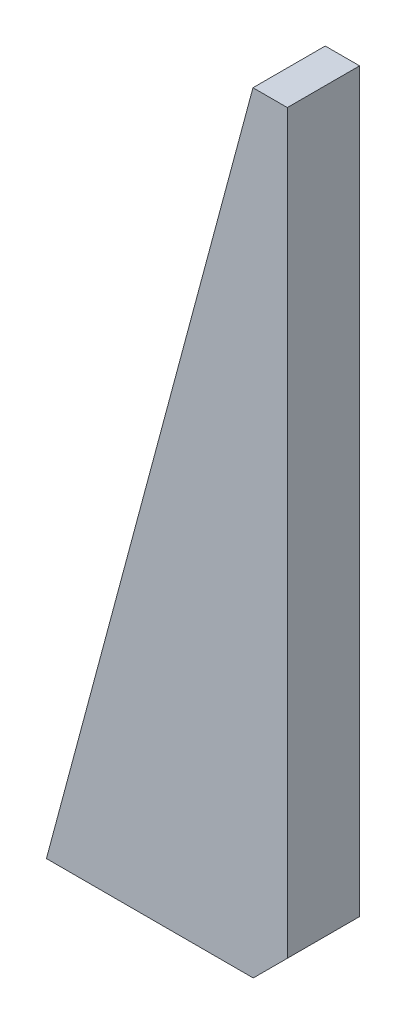
ISO-10303-21;
HEADER;
FILE_DESCRIPTION(('STEP AP214'),'2;1');
FILE_NAME('part.step','',(''),(''),'','','');
FILE_SCHEMA(('AUTOMOTIVE_DESIGN { 1 0 10303 214 1 1 1 1 }'));
ENDSEC;
DATA;
#1=APPLICATION_CONTEXT('core data for automotive mechanical design processes');
#2=APPLICATION_PROTOCOL_DEFINITION('international standard','automotive_design',2000,#1);
#3=PRODUCT_CONTEXT('',#1,'mechanical');
#4=PRODUCT('Part','Part','',(#3));
#5=PRODUCT_RELATED_PRODUCT_CATEGORY('part','',(#4));
#6=PRODUCT_DEFINITION_FORMATION('','',#4);
#7=PRODUCT_DEFINITION_CONTEXT('part definition',#1,'design');
#8=PRODUCT_DEFINITION('design','',#6,#7);
#9=PRODUCT_DEFINITION_SHAPE('','',#8);
#10=(LENGTH_UNIT() NAMED_UNIT(*) SI_UNIT(.MILLI.,.METRE.));
#11=(NAMED_UNIT(*) PLANE_ANGLE_UNIT() SI_UNIT($,.RADIAN.));
#12=(NAMED_UNIT(*) SI_UNIT($,.STERADIAN.) SOLID_ANGLE_UNIT());
#13=UNCERTAINTY_MEASURE_WITH_UNIT(LENGTH_MEASURE(1.E-05),#10,'distance_accuracy_value','');
#14=(GEOMETRIC_REPRESENTATION_CONTEXT(3) GLOBAL_UNCERTAINTY_ASSIGNED_CONTEXT((#13)) GLOBAL_UNIT_ASSIGNED_CONTEXT((#10,
#11,#12)) REPRESENTATION_CONTEXT('',''));
#15=CARTESIAN_POINT('',(0.,0.,0.));
#16=DIRECTION('',(0.,0.,1.));
#17=DIRECTION('',(1.,0.,0.));
#18=AXIS2_PLACEMENT_3D('',#15,#16,#17);
#19=CARTESIAN_POINT('',(-50.,0.,-15.));
#20=DIRECTION('',(-0.965925826289069,0.258819045102518,0.));
#21=DIRECTION('',(-0.258819045102518,-0.965925826289069,0.));
#22=AXIS2_PLACEMENT_3D('',#19,#20,#21);
#23=PLANE('',#22);
#24=DIRECTION('',(-0.258819045102518,-0.965925826289069,0.));
#25=VECTOR('',#24,1.);
#26=CARTESIAN_POINT('',(-50.,0.,0.));
#27=LINE('',#26,#25);
#28=CARTESIAN_POINT('',(-7.12812921102088,160.,0.));
#29=VERTEX_POINT('',#28);
#30=CARTESIAN_POINT('',(-50.,0.,0.));
#31=VERTEX_POINT('',#30);
#32=EDGE_CURVE('E110',#29,#31,#27,.T.);
#33=ORIENTED_EDGE('',*,*,#32,.F.);
#34=DIRECTION('',(0.,0.,1.));
#35=VECTOR('',#34,1.);
#36=CARTESIAN_POINT('',(-7.12812921102088,160.,-15.));
#37=LINE('',#36,#35);
#38=CARTESIAN_POINT('',(-7.12812921102088,160.,-15.));
#39=VERTEX_POINT('',#38);
#40=EDGE_CURVE('E11',#39,#29,#37,.T.);
#41=ORIENTED_EDGE('',*,*,#40,.F.);
#42=DIRECTION('',(-0.258819045102518,-0.965925826289069,0.));
#43=VECTOR('',#42,1.);
#44=CARTESIAN_POINT('',(-50.,0.,-15.));
#45=LINE('',#44,#43);
#46=CARTESIAN_POINT('',(-50.,0.,-15.));
#47=VERTEX_POINT('',#46);
#48=EDGE_CURVE('E105',#39,#47,#45,.T.);
#49=ORIENTED_EDGE('',*,*,#48,.T.);
#50=DIRECTION('',(0.,0.,1.));
#51=VECTOR('',#50,1.);
#52=CARTESIAN_POINT('',(-50.,0.,-15.));
#53=LINE('',#52,#51);
#54=EDGE_CURVE('E36',#47,#31,#53,.T.);
#55=ORIENTED_EDGE('',*,*,#54,.T.);
#56=EDGE_LOOP('',(#33,#41,#49,#55));
#57=FACE_BOUND('',#56,.T.);
#58=ADVANCED_FACE('F33',(#57),#23,.T.);
#59=CARTESIAN_POINT('',(-7.12812921102088,160.,-15.));
#60=DIRECTION('',(0.,1.,0.));
#61=DIRECTION('',(0.,0.,1.));
#62=AXIS2_PLACEMENT_3D('',#59,#60,#61);
#63=PLANE('',#62);
#64=DIRECTION('',(-1.,0.,0.));
#65=VECTOR('',#64,1.);
#66=CARTESIAN_POINT('',(-7.12812921102088,160.,0.));
#67=LINE('',#66,#65);
#68=CARTESIAN_POINT('',(0.,160.,0.));
#69=VERTEX_POINT('',#68);
#70=EDGE_CURVE('E119',#69,#29,#67,.T.);
#71=ORIENTED_EDGE('',*,*,#70,.F.);
#72=DIRECTION('',(0.,0.,1.));
#73=VECTOR('',#72,1.);
#74=CARTESIAN_POINT('',(0.,160.,-15.));
#75=LINE('',#74,#73);
#76=CARTESIAN_POINT('',(0.,160.,-15.));
#77=VERTEX_POINT('',#76);
#78=EDGE_CURVE('E42',#77,#69,#75,.T.);
#79=ORIENTED_EDGE('',*,*,#78,.F.);
#80=DIRECTION('',(-1.,0.,0.));
#81=VECTOR('',#80,1.);
#82=CARTESIAN_POINT('',(-7.12812921102088,160.,-15.));
#83=LINE('',#82,#81);
#84=EDGE_CURVE('E100',#77,#39,#83,.T.);
#85=ORIENTED_EDGE('',*,*,#84,.T.);
#86=ORIENTED_EDGE('',*,*,#40,.T.);
#87=EDGE_LOOP('',(#71,#79,#85,#86));
#88=FACE_BOUND('',#87,.T.);
#89=ADVANCED_FACE('F125',(#88),#63,.T.);
#90=CARTESIAN_POINT('',(0.,160.,-15.));
#91=DIRECTION('',(1.,0.,0.));
#92=DIRECTION('',(0.,1.,0.));
#93=AXIS2_PLACEMENT_3D('',#90,#91,#92);
#94=PLANE('',#93);
#95=DIRECTION('',(0.,1.,0.));
#96=VECTOR('',#95,1.);
#97=CARTESIAN_POINT('',(0.,160.,0.));
#98=LINE('',#97,#96);
#99=CARTESIAN_POINT('',(0.,7.07106781186549,0.));
#100=VERTEX_POINT('',#99);
#101=EDGE_CURVE('E89',#100,#69,#98,.T.);
#102=ORIENTED_EDGE('',*,*,#101,.F.);
#103=DIRECTION('',(0.,0.,1.));
#104=VECTOR('',#103,1.);
#105=CARTESIAN_POINT('',(0.,7.07106781186549,-15.));
#106=LINE('',#105,#104);
#107=CARTESIAN_POINT('',(0.,7.07106781186549,-15.));
#108=VERTEX_POINT('',#107);
#109=EDGE_CURVE('E84',#108,#100,#106,.T.);
#110=ORIENTED_EDGE('',*,*,#109,.F.);
#111=DIRECTION('',(0.,1.,0.));
#112=VECTOR('',#111,1.);
#113=CARTESIAN_POINT('',(0.,160.,-15.));
#114=LINE('',#113,#112);
#115=EDGE_CURVE('E87',#108,#77,#114,.T.);
#116=ORIENTED_EDGE('',*,*,#115,.T.);
#117=ORIENTED_EDGE('',*,*,#78,.T.);
#118=EDGE_LOOP('',(#102,#110,#116,#117));
#119=FACE_BOUND('',#118,.T.);
#120=ADVANCED_FACE('F86',(#119),#94,.T.);
#121=CARTESIAN_POINT('',(-7.07106781186546,0.,-15.));
#122=DIRECTION('',(0.707106781186549,-0.707106781186546,0.));
#123=DIRECTION('',(0.707106781186546,0.707106781186549,0.));
#124=AXIS2_PLACEMENT_3D('',#121,#122,#123);
#125=PLANE('',#124);
#126=DIRECTION('',(0.707106781186546,0.707106781186549,0.));
#127=VECTOR('',#126,1.);
#128=CARTESIAN_POINT('',(-7.07106781186546,0.,0.));
#129=LINE('',#128,#127);
#130=CARTESIAN_POINT('',(-7.07106781186546,0.,0.));
#131=VERTEX_POINT('',#130);
#132=EDGE_CURVE('E116',#131,#100,#129,.T.);
#133=ORIENTED_EDGE('',*,*,#132,.F.);
#134=DIRECTION('',(0.,0.,1.));
#135=VECTOR('',#134,1.);
#136=CARTESIAN_POINT('',(-7.07106781186546,0.,-15.));
#137=LINE('',#136,#135);
#138=CARTESIAN_POINT('',(-7.07106781186546,0.,-15.));
#139=VERTEX_POINT('',#138);
#140=EDGE_CURVE('E94',#139,#131,#137,.T.);
#141=ORIENTED_EDGE('',*,*,#140,.F.);
#142=DIRECTION('',(0.707106781186546,0.707106781186549,0.));
#143=VECTOR('',#142,1.);
#144=CARTESIAN_POINT('',(-7.07106781186546,0.,-15.));
#145=LINE('',#144,#143);
#146=EDGE_CURVE('E99',#139,#108,#145,.T.);
#147=ORIENTED_EDGE('',*,*,#146,.T.);
#148=ORIENTED_EDGE('',*,*,#109,.T.);
#149=EDGE_LOOP('',(#133,#141,#147,#148));
#150=FACE_BOUND('',#149,.T.);
#151=ADVANCED_FACE('F102',(#150),#125,.T.);
#152=CARTESIAN_POINT('',(-50.,0.,-15.));
#153=DIRECTION('',(0.,-1.,0.));
#154=DIRECTION('',(1.,0.,0.));
#155=AXIS2_PLACEMENT_3D('',#152,#153,#154);
#156=PLANE('',#155);
#157=DIRECTION('',(1.,0.,0.));
#158=VECTOR('',#157,1.);
#159=CARTESIAN_POINT('',(-50.,0.,0.));
#160=LINE('',#159,#158);
#161=EDGE_CURVE('E113',#31,#131,#160,.T.);
#162=ORIENTED_EDGE('',*,*,#161,.F.);
#163=ORIENTED_EDGE('',*,*,#54,.F.);
#164=DIRECTION('',(1.,0.,0.));
#165=VECTOR('',#164,1.);
#166=CARTESIAN_POINT('',(-50.,0.,-15.));
#167=LINE('',#166,#165);
#168=EDGE_CURVE('E103',#47,#139,#167,.T.);
#169=ORIENTED_EDGE('',*,*,#168,.T.);
#170=ORIENTED_EDGE('',*,*,#140,.T.);
#171=EDGE_LOOP('',(#162,#163,#169,#170));
#172=FACE_BOUND('',#171,.T.);
#173=ADVANCED_FACE('F122',(#172),#156,.T.);
#174=CARTESIAN_POINT('',(0.,0.,-15.));
#175=DIRECTION('',(0.,0.,-1.));
#176=DIRECTION('',(-1.,0.,0.));
#177=AXIS2_PLACEMENT_3D('',#174,#175,#176);
#178=PLANE('',#177);
#179=ORIENTED_EDGE('',*,*,#48,.F.);
#180=ORIENTED_EDGE('',*,*,#84,.F.);
#181=ORIENTED_EDGE('',*,*,#115,.F.);
#182=ORIENTED_EDGE('',*,*,#146,.F.);
#183=ORIENTED_EDGE('',*,*,#168,.F.);
#184=EDGE_LOOP('',(#179,#180,#181,#182,#183));
#185=FACE_BOUND('',#184,.T.);
#186=ADVANCED_FACE('F98',(#185),#178,.T.);
#187=CARTESIAN_POINT('',(0.,0.,0.));
#188=DIRECTION('',(0.,0.,-1.));
#189=DIRECTION('',(-1.,0.,0.));
#190=AXIS2_PLACEMENT_3D('',#187,#188,#189);
#191=PLANE('',#190);
#192=ORIENTED_EDGE('',*,*,#32,.T.);
#193=ORIENTED_EDGE('',*,*,#161,.T.);
#194=ORIENTED_EDGE('',*,*,#132,.T.);
#195=ORIENTED_EDGE('',*,*,#101,.T.);
#196=ORIENTED_EDGE('',*,*,#70,.T.);
#197=EDGE_LOOP('',(#192,#193,#194,#195,#196));
#198=FACE_BOUND('',#197,.T.);
#199=ADVANCED_FACE('F124',(#198),#191,.F.);
#200=CLOSED_SHELL('',(#58,#89,#120,#151,#173,#186,#199));
#201=MANIFOLD_SOLID_BREP('B2',#200);
#202=ADVANCED_BREP_SHAPE_REPRESENTATION('',(#18,#201),#14);
#203=SHAPE_DEFINITION_REPRESENTATION(#9,#202);
ENDSEC;
END-ISO-10303-21;
